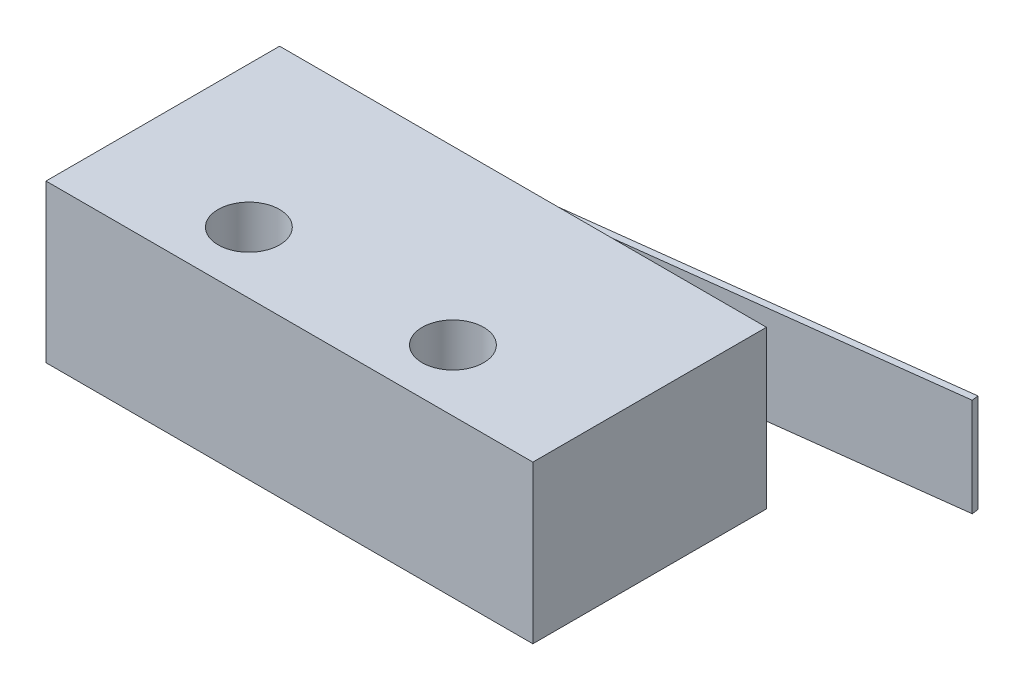
ISO-10303-21;
HEADER;
FILE_DESCRIPTION(('STEP AP214'),'2;1');
FILE_NAME('part.step','',(''),(''),'','','');
FILE_SCHEMA(('AUTOMOTIVE_DESIGN { 1 0 10303 214 1 1 1 1 }'));
ENDSEC;
DATA;
#1=APPLICATION_CONTEXT('core data for automotive mechanical design processes');
#2=APPLICATION_PROTOCOL_DEFINITION('international standard','automotive_design',2000,#1);
#3=PRODUCT_CONTEXT('',#1,'mechanical');
#4=PRODUCT('Part','Part','',(#3));
#5=PRODUCT_RELATED_PRODUCT_CATEGORY('part','',(#4));
#6=PRODUCT_DEFINITION_FORMATION('','',#4);
#7=PRODUCT_DEFINITION_CONTEXT('part definition',#1,'design');
#8=PRODUCT_DEFINITION('design','',#6,#7);
#9=PRODUCT_DEFINITION_SHAPE('','',#8);
#10=(LENGTH_UNIT() NAMED_UNIT(*) SI_UNIT(.MILLI.,.METRE.));
#11=(NAMED_UNIT(*) PLANE_ANGLE_UNIT() SI_UNIT($,.RADIAN.));
#12=(NAMED_UNIT(*) SI_UNIT($,.STERADIAN.) SOLID_ANGLE_UNIT());
#13=UNCERTAINTY_MEASURE_WITH_UNIT(LENGTH_MEASURE(1.E-05),#10,'distance_accuracy_value','');
#14=(GEOMETRIC_REPRESENTATION_CONTEXT(3) GLOBAL_UNCERTAINTY_ASSIGNED_CONTEXT((#13)) GLOBAL_UNIT_ASSIGNED_CONTEXT((#10,
#11,#12)) REPRESENTATION_CONTEXT('',''));
#15=CARTESIAN_POINT('',(0.,0.,0.));
#16=DIRECTION('',(0.,0.,1.));
#17=DIRECTION('',(1.,0.,0.));
#18=AXIS2_PLACEMENT_3D('',#15,#16,#17);
#19=CARTESIAN_POINT('',(2.6449664833805,1.2,-9.5));
#20=DIRECTION('',(-0.992405924911537,0.,0.123006016927943));
#21=DIRECTION('',(0.123006016927943,0.,0.992405924911537));
#22=AXIS2_PLACEMENT_3D('',#19,#20,#21);
#23=PLANE('',#22);
#24=DIRECTION('',(0.123006016927943,0.,0.992405924911537));
#25=VECTOR('',#24,1.);
#26=CARTESIAN_POINT('',(2.6449664833805,5.2,-9.5));
#27=LINE('',#26,#25);
#28=CARTESIAN_POINT('',(2.61167271990355,5.2,-9.76861229200262));
#29=VERTEX_POINT('',#28);
#30=CARTESIAN_POINT('',(2.6449664833805,5.2,-9.5));
#31=VERTEX_POINT('',#30);
#32=EDGE_CURVE('E107',#29,#31,#27,.T.);
#33=ORIENTED_EDGE('',*,*,#32,.F.);
#34=DIRECTION('',(0.,1.,0.));
#35=VECTOR('',#34,1.);
#36=CARTESIAN_POINT('',(2.61167271990355,1.2,-9.76861229200262));
#37=LINE('',#36,#35);
#38=CARTESIAN_POINT('',(2.61167271990355,1.2,-9.76861229200262));
#39=VERTEX_POINT('',#38);
#40=EDGE_CURVE('E12',#39,#29,#37,.T.);
#41=ORIENTED_EDGE('',*,*,#40,.F.);
#42=DIRECTION('',(0.123006016927943,0.,0.992405924911537));
#43=VECTOR('',#42,1.);
#44=CARTESIAN_POINT('',(2.6449664833805,1.2,-9.5));
#45=LINE('',#44,#43);
#46=CARTESIAN_POINT('',(2.6449664833805,1.2,-9.5));
#47=VERTEX_POINT('',#46);
#48=EDGE_CURVE('E101',#39,#47,#45,.T.);
#49=ORIENTED_EDGE('',*,*,#48,.T.);
#50=DIRECTION('',(0.,1.,0.));
#51=VECTOR('',#50,1.);
#52=CARTESIAN_POINT('',(2.6449664833805,1.2,-9.5));
#53=LINE('',#52,#51);
#54=EDGE_CURVE('E46',#47,#31,#53,.T.);
#55=ORIENTED_EDGE('',*,*,#54,.T.);
#56=EDGE_LOOP('',(#33,#41,#49,#55));
#57=FACE_BOUND('',#56,.T.);
#58=ADVANCED_FACE('F43',(#57),#23,.T.);
#59=CARTESIAN_POINT('',(2.61167271990355,1.2,-9.76861229200262));
#60=DIRECTION('',(-0.123006016927943,0.,-0.992405924911537));
#61=DIRECTION('',(-0.992405924911537,0.,0.123006016927943));
#62=AXIS2_PLACEMENT_3D('',#59,#60,#61);
#63=PLANE('',#62);
#64=DIRECTION('',(-0.992405924911537,0.,0.123006016927943));
#65=VECTOR('',#64,1.);
#66=CARTESIAN_POINT('',(2.61167271990355,5.2,-9.76861229200262));
#67=LINE('',#66,#65);
#68=CARTESIAN_POINT('',(25.3205174670459,5.2,-12.5833118733559));
#69=VERTEX_POINT('',#68);
#70=EDGE_CURVE('E103',#69,#29,#67,.T.);
#71=ORIENTED_EDGE('',*,*,#70,.F.);
#72=DIRECTION('',(0.,1.,0.));
#73=VECTOR('',#72,1.);
#74=CARTESIAN_POINT('',(25.3205174670459,1.2,-12.5833118733559));
#75=LINE('',#74,#73);
#76=CARTESIAN_POINT('',(25.3205174670459,1.2,-12.5833118733559));
#77=VERTEX_POINT('',#76);
#78=EDGE_CURVE('E52',#77,#69,#75,.T.);
#79=ORIENTED_EDGE('',*,*,#78,.F.);
#80=DIRECTION('',(-0.992405924911537,0.,0.123006016927943));
#81=VECTOR('',#80,1.);
#82=CARTESIAN_POINT('',(2.61167271990355,1.2,-9.76861229200262));
#83=LINE('',#82,#81);
#84=EDGE_CURVE('E98',#77,#39,#83,.T.);
#85=ORIENTED_EDGE('',*,*,#84,.T.);
#86=ORIENTED_EDGE('',*,*,#40,.T.);
#87=EDGE_LOOP('',(#71,#79,#85,#86));
#88=FACE_BOUND('',#87,.T.);
#89=ADVANCED_FACE('F117',(#88),#63,.T.);
#90=CARTESIAN_POINT('',(25.3538112305228,1.2,-12.3146995813533));
#91=DIRECTION('',(0.992405924911537,0.,-0.123006016927942));
#92=DIRECTION('',(-0.123006016927942,0.,-0.992405924911537));
#93=AXIS2_PLACEMENT_3D('',#90,#91,#92);
#94=PLANE('',#93);
#95=DIRECTION('',(-0.123006016927942,0.,-0.992405924911537));
#96=VECTOR('',#95,1.);
#97=CARTESIAN_POINT('',(25.3538112305228,5.2,-12.3146995813533));
#98=LINE('',#97,#96);
#99=CARTESIAN_POINT('',(25.3538112305228,5.2,-12.3146995813533));
#100=VERTEX_POINT('',#99);
#101=EDGE_CURVE('E93',#100,#69,#98,.T.);
#102=ORIENTED_EDGE('',*,*,#101,.F.);
#103=DIRECTION('',(0.,1.,0.));
#104=VECTOR('',#103,1.);
#105=CARTESIAN_POINT('',(25.3538112305228,1.2,-12.3146995813533));
#106=LINE('',#105,#104);
#107=CARTESIAN_POINT('',(25.3538112305228,1.2,-12.3146995813533));
#108=VERTEX_POINT('',#107);
#109=EDGE_CURVE('E88',#108,#100,#106,.T.);
#110=ORIENTED_EDGE('',*,*,#109,.F.);
#111=DIRECTION('',(-0.123006016927942,0.,-0.992405924911537));
#112=VECTOR('',#111,1.);
#113=CARTESIAN_POINT('',(25.3538112305228,1.2,-12.3146995813533));
#114=LINE('',#113,#112);
#115=EDGE_CURVE('E91',#108,#77,#114,.T.);
#116=ORIENTED_EDGE('',*,*,#115,.T.);
#117=ORIENTED_EDGE('',*,*,#78,.T.);
#118=EDGE_LOOP('',(#102,#110,#116,#117));
#119=FACE_BOUND('',#118,.T.);
#120=ADVANCED_FACE('F90',(#119),#94,.T.);
#121=CARTESIAN_POINT('',(2.6449664833805,1.2,-9.5));
#122=DIRECTION('',(0.123006016927943,0.,0.992405924911537));
#123=DIRECTION('',(0.992405924911537,0.,-0.123006016927943));
#124=AXIS2_PLACEMENT_3D('',#121,#122,#123);
#125=PLANE('',#124);
#126=DIRECTION('',(0.992405924911537,0.,-0.123006016927943));
#127=VECTOR('',#126,1.);
#128=CARTESIAN_POINT('',(2.6449664833805,5.2,-9.5));
#129=LINE('',#128,#127);
#130=EDGE_CURVE('E110',#31,#100,#129,.T.);
#131=ORIENTED_EDGE('',*,*,#130,.F.);
#132=ORIENTED_EDGE('',*,*,#54,.F.);
#133=DIRECTION('',(0.992405924911537,0.,-0.123006016927943));
#134=VECTOR('',#133,1.);
#135=CARTESIAN_POINT('',(2.6449664833805,1.2,-9.5));
#136=LINE('',#135,#134);
#137=EDGE_CURVE('E97',#47,#108,#136,.T.);
#138=ORIENTED_EDGE('',*,*,#137,.T.);
#139=ORIENTED_EDGE('',*,*,#109,.T.);
#140=EDGE_LOOP('',(#131,#132,#138,#139));
#141=FACE_BOUND('',#140,.T.);
#142=ADVANCED_FACE('F100',(#141),#125,.T.);
#143=CARTESIAN_POINT('',(0.,1.2,0.));
#144=DIRECTION('',(0.,-1.,0.));
#145=DIRECTION('',(0.,0.,-1.));
#146=AXIS2_PLACEMENT_3D('',#143,#144,#145);
#147=PLANE('',#146);
#148=ORIENTED_EDGE('',*,*,#48,.F.);
#149=ORIENTED_EDGE('',*,*,#84,.F.);
#150=ORIENTED_EDGE('',*,*,#115,.F.);
#151=ORIENTED_EDGE('',*,*,#137,.F.);
#152=EDGE_LOOP('',(#148,#149,#150,#151));
#153=FACE_BOUND('',#152,.T.);
#154=ADVANCED_FACE('F96',(#153),#147,.T.);
#155=CARTESIAN_POINT('',(0.,5.2,0.));
#156=DIRECTION('',(0.,-1.,0.));
#157=DIRECTION('',(0.,0.,-1.));
#158=AXIS2_PLACEMENT_3D('',#155,#156,#157);
#159=PLANE('',#158);
#160=ORIENTED_EDGE('',*,*,#32,.T.);
#161=ORIENTED_EDGE('',*,*,#130,.T.);
#162=ORIENTED_EDGE('',*,*,#101,.T.);
#163=ORIENTED_EDGE('',*,*,#70,.T.);
#164=EDGE_LOOP('',(#160,#161,#162,#163));
#165=FACE_BOUND('',#164,.T.);
#166=ADVANCED_FACE('F116',(#165),#159,.F.);
#167=CLOSED_SHELL('',(#58,#89,#120,#142,#154,#166));
#168=MANIFOLD_SOLID_BREP('B2',#167);
#169=CARTESIAN_POINT('',(0.,6.4,0.));
#170=DIRECTION('',(1.,0.,0.));
#171=DIRECTION('',(0.,0.,-1.));
#172=AXIS2_PLACEMENT_3D('',#169,#170,#171);
#173=PLANE('',#172);
#174=DIRECTION('',(0.,0.,1.));
#175=VECTOR('',#174,1.);
#176=CARTESIAN_POINT('',(0.,0.,0.));
#177=LINE('',#176,#175);
#178=CARTESIAN_POINT('',(0.,0.,-9.5));
#179=VERTEX_POINT('',#178);
#180=CARTESIAN_POINT('',(0.,0.,0.));
#181=VERTEX_POINT('',#180);
#182=EDGE_CURVE('E230',#179,#181,#177,.T.);
#183=ORIENTED_EDGE('',*,*,#182,.T.);
#184=DIRECTION('',(0.,-1.,0.));
#185=VECTOR('',#184,1.);
#186=CARTESIAN_POINT('',(0.,6.4,0.));
#187=LINE('',#186,#185);
#188=CARTESIAN_POINT('',(0.,6.4,0.));
#189=VERTEX_POINT('',#188);
#190=EDGE_CURVE('E41',#189,#181,#187,.T.);
#191=ORIENTED_EDGE('',*,*,#190,.F.);
#192=DIRECTION('',(0.,0.,1.));
#193=VECTOR('',#192,1.);
#194=CARTESIAN_POINT('',(0.,6.4,0.));
#195=LINE('',#194,#193);
#196=CARTESIAN_POINT('',(0.,6.4,-9.5));
#197=VERTEX_POINT('',#196);
#198=EDGE_CURVE('E218',#197,#189,#195,.T.);
#199=ORIENTED_EDGE('',*,*,#198,.F.);
#200=DIRECTION('',(0.,-1.,0.));
#201=VECTOR('',#200,1.);
#202=CARTESIAN_POINT('',(0.,6.4,-9.5));
#203=LINE('',#202,#201);
#204=EDGE_CURVE('E226',#197,#179,#203,.T.);
#205=ORIENTED_EDGE('',*,*,#204,.T.);
#206=EDGE_LOOP('',(#183,#191,#199,#205));
#207=FACE_BOUND('',#206,.T.);
#208=ADVANCED_FACE('F167',(#207),#173,.F.);
#209=CARTESIAN_POINT('',(0.,6.4,0.));
#210=DIRECTION('',(0.,0.,-1.));
#211=DIRECTION('',(-1.,0.,0.));
#212=AXIS2_PLACEMENT_3D('',#209,#210,#211);
#213=PLANE('',#212);
#214=DIRECTION('',(1.,0.,0.));
#215=VECTOR('',#214,1.);
#216=CARTESIAN_POINT('',(0.,0.,0.));
#217=LINE('',#216,#215);
#218=CARTESIAN_POINT('',(19.8,0.,0.));
#219=VERTEX_POINT('',#218);
#220=EDGE_CURVE('E222',#181,#219,#217,.T.);
#221=ORIENTED_EDGE('',*,*,#220,.T.);
#222=DIRECTION('',(0.,-1.,0.));
#223=VECTOR('',#222,1.);
#224=CARTESIAN_POINT('',(19.8,6.4,0.));
#225=LINE('',#224,#223);
#226=CARTESIAN_POINT('',(19.8,6.4,0.));
#227=VERTEX_POINT('',#226);
#228=EDGE_CURVE('E175',#227,#219,#225,.T.);
#229=ORIENTED_EDGE('',*,*,#228,.F.);
#230=DIRECTION('',(1.,0.,0.));
#231=VECTOR('',#230,1.);
#232=CARTESIAN_POINT('',(0.,6.4,0.));
#233=LINE('',#232,#231);
#234=EDGE_CURVE('E213',#189,#227,#233,.T.);
#235=ORIENTED_EDGE('',*,*,#234,.F.);
#236=ORIENTED_EDGE('',*,*,#190,.T.);
#237=EDGE_LOOP('',(#221,#229,#235,#236));
#238=FACE_BOUND('',#237,.T.);
#239=ADVANCED_FACE('F221',(#238),#213,.F.);
#240=CARTESIAN_POINT('',(19.8,6.4,0.));
#241=DIRECTION('',(-1.,0.,0.));
#242=DIRECTION('',(0.,0.,1.));
#243=AXIS2_PLACEMENT_3D('',#240,#241,#242);
#244=PLANE('',#243);
#245=DIRECTION('',(0.,0.,-1.));
#246=VECTOR('',#245,1.);
#247=CARTESIAN_POINT('',(19.8,0.,0.));
#248=LINE('',#247,#246);
#249=CARTESIAN_POINT('',(19.8,0.,-9.5));
#250=VERTEX_POINT('',#249);
#251=EDGE_CURVE('E200',#219,#250,#248,.T.);
#252=ORIENTED_EDGE('',*,*,#251,.T.);
#253=DIRECTION('',(0.,-1.,0.));
#254=VECTOR('',#253,1.);
#255=CARTESIAN_POINT('',(19.8,6.4,-9.5));
#256=LINE('',#255,#254);
#257=CARTESIAN_POINT('',(19.8,6.4,-9.5));
#258=VERTEX_POINT('',#257);
#259=EDGE_CURVE('E223',#258,#250,#256,.T.);
#260=ORIENTED_EDGE('',*,*,#259,.F.);
#261=DIRECTION('',(0.,0.,-1.));
#262=VECTOR('',#261,1.);
#263=CARTESIAN_POINT('',(19.8,6.4,0.));
#264=LINE('',#263,#262);
#265=EDGE_CURVE('E216',#227,#258,#264,.T.);
#266=ORIENTED_EDGE('',*,*,#265,.F.);
#267=ORIENTED_EDGE('',*,*,#228,.T.);
#268=EDGE_LOOP('',(#252,#260,#266,#267));
#269=FACE_BOUND('',#268,.T.);
#270=ADVANCED_FACE('F224',(#269),#244,.F.);
#271=CARTESIAN_POINT('',(0.,6.4,-9.5));
#272=DIRECTION('',(0.,0.,1.));
#273=DIRECTION('',(1.,0.,0.));
#274=AXIS2_PLACEMENT_3D('',#271,#272,#273);
#275=PLANE('',#274);
#276=DIRECTION('',(-1.,0.,0.));
#277=VECTOR('',#276,1.);
#278=CARTESIAN_POINT('',(0.,0.,-9.5));
#279=LINE('',#278,#277);
#280=EDGE_CURVE('E206',#250,#179,#279,.T.);
#281=ORIENTED_EDGE('',*,*,#280,.T.);
#282=ORIENTED_EDGE('',*,*,#204,.F.);
#283=DIRECTION('',(-1.,0.,0.));
#284=VECTOR('',#283,1.);
#285=CARTESIAN_POINT('',(0.,6.4,-9.5));
#286=LINE('',#285,#284);
#287=EDGE_CURVE('E183',#258,#197,#286,.T.);
#288=ORIENTED_EDGE('',*,*,#287,.F.);
#289=ORIENTED_EDGE('',*,*,#259,.T.);
#290=EDGE_LOOP('',(#281,#282,#288,#289));
#291=FACE_BOUND('',#290,.T.);
#292=ADVANCED_FACE('F238',(#291),#275,.F.);
#293=CARTESIAN_POINT('',(0.,6.4,0.));
#294=DIRECTION('',(0.,-1.,0.));
#295=DIRECTION('',(0.,0.,-1.));
#296=AXIS2_PLACEMENT_3D('',#293,#294,#295);
#297=PLANE('',#296);
#298=CARTESIAN_POINT('',(5.75,6.4,-2.5));
#299=DIRECTION('',(0.,1.,0.));
#300=DIRECTION('',(0.,0.,1.));
#301=AXIS2_PLACEMENT_3D('',#298,#299,#300);
#302=CIRCLE('',#301,1.25);
#303=CARTESIAN_POINT('',(5.75,6.4,-1.25));
#304=VERTEX_POINT('',#303);
#305=EDGE_CURVE('E250',#304,#304,#302,.T.);
#306=ORIENTED_EDGE('',*,*,#305,.F.);
#307=EDGE_LOOP('',(#306));
#308=FACE_BOUND('',#307,.T.);
#309=CARTESIAN_POINT('',(14.05,6.4,-2.5));
#310=DIRECTION('',(0.,1.,0.));
#311=DIRECTION('',(0.,0.,1.));
#312=AXIS2_PLACEMENT_3D('',#309,#310,#311);
#313=CIRCLE('',#312,1.25);
#314=CARTESIAN_POINT('',(14.05,6.4,-1.25));
#315=VERTEX_POINT('',#314);
#316=EDGE_CURVE('E244',#315,#315,#313,.T.);
#317=ORIENTED_EDGE('',*,*,#316,.F.);
#318=EDGE_LOOP('',(#317));
#319=FACE_BOUND('',#318,.T.);
#320=ORIENTED_EDGE('',*,*,#198,.T.);
#321=ORIENTED_EDGE('',*,*,#234,.T.);
#322=ORIENTED_EDGE('',*,*,#265,.T.);
#323=ORIENTED_EDGE('',*,*,#287,.T.);
#324=EDGE_LOOP('',(#320,#321,#322,#323));
#325=FACE_BOUND('',#324,.T.);
#326=ADVANCED_FACE('F214',(#308,#319,#325),#297,.F.);
#327=CARTESIAN_POINT('',(0.,0.,0.));
#328=DIRECTION('',(0.,-1.,0.));
#329=DIRECTION('',(0.,0.,-1.));
#330=AXIS2_PLACEMENT_3D('',#327,#328,#329);
#331=PLANE('',#330);
#332=CARTESIAN_POINT('',(5.75,0.,-2.5));
#333=DIRECTION('',(0.,1.,0.));
#334=DIRECTION('',(0.,0.,1.));
#335=AXIS2_PLACEMENT_3D('',#332,#333,#334);
#336=CIRCLE('',#335,1.25);
#337=CARTESIAN_POINT('',(5.75,0.,-1.25));
#338=VERTEX_POINT('',#337);
#339=EDGE_CURVE('E233',#338,#338,#336,.T.);
#340=ORIENTED_EDGE('',*,*,#339,.T.);
#341=EDGE_LOOP('',(#340));
#342=FACE_BOUND('',#341,.T.);
#343=CARTESIAN_POINT('',(14.05,0.,-2.5));
#344=DIRECTION('',(0.,1.,0.));
#345=DIRECTION('',(0.,0.,1.));
#346=AXIS2_PLACEMENT_3D('',#343,#344,#345);
#347=CIRCLE('',#346,1.25);
#348=CARTESIAN_POINT('',(14.05,0.,-1.25));
#349=VERTEX_POINT('',#348);
#350=EDGE_CURVE('E247',#349,#349,#347,.T.);
#351=ORIENTED_EDGE('',*,*,#350,.T.);
#352=EDGE_LOOP('',(#351));
#353=FACE_BOUND('',#352,.T.);
#354=ORIENTED_EDGE('',*,*,#182,.F.);
#355=ORIENTED_EDGE('',*,*,#280,.F.);
#356=ORIENTED_EDGE('',*,*,#251,.F.);
#357=ORIENTED_EDGE('',*,*,#220,.F.);
#358=EDGE_LOOP('',(#354,#355,#356,#357));
#359=FACE_BOUND('',#358,.T.);
#360=ADVANCED_FACE('F241',(#342,#353,#359),#331,.T.);
#361=CARTESIAN_POINT('',(14.05,0.,-2.5));
#362=DIRECTION('',(0.,1.,0.));
#363=DIRECTION('',(0.,0.,1.));
#364=AXIS2_PLACEMENT_3D('',#361,#362,#363);
#365=CYLINDRICAL_SURFACE('',#364,1.25);
#366=ORIENTED_EDGE('',*,*,#350,.F.);
#367=EDGE_LOOP('',(#366));
#368=FACE_BOUND('',#367,.T.);
#369=ORIENTED_EDGE('',*,*,#316,.T.);
#370=EDGE_LOOP('',(#369));
#371=FACE_BOUND('',#370,.T.);
#372=ADVANCED_FACE('F261',(#368,#371),#365,.F.);
#373=CARTESIAN_POINT('',(5.75,0.,-2.5));
#374=DIRECTION('',(0.,1.,0.));
#375=DIRECTION('',(0.,0.,1.));
#376=AXIS2_PLACEMENT_3D('',#373,#374,#375);
#377=CYLINDRICAL_SURFACE('',#376,1.25);
#378=ORIENTED_EDGE('',*,*,#339,.F.);
#379=EDGE_LOOP('',(#378));
#380=FACE_BOUND('',#379,.T.);
#381=ORIENTED_EDGE('',*,*,#305,.T.);
#382=EDGE_LOOP('',(#381));
#383=FACE_BOUND('',#382,.T.);
#384=ADVANCED_FACE('F258',(#380,#383),#377,.F.);
#385=CLOSED_SHELL('',(#208,#239,#270,#292,#326,#360,#372,#384));
#386=MANIFOLD_SOLID_BREP('B6',#385);
#387=ADVANCED_BREP_SHAPE_REPRESENTATION('',(#18,#168,#386),#14);
#388=SHAPE_DEFINITION_REPRESENTATION(#9,#387);
ENDSEC;
END-ISO-10303-21;
